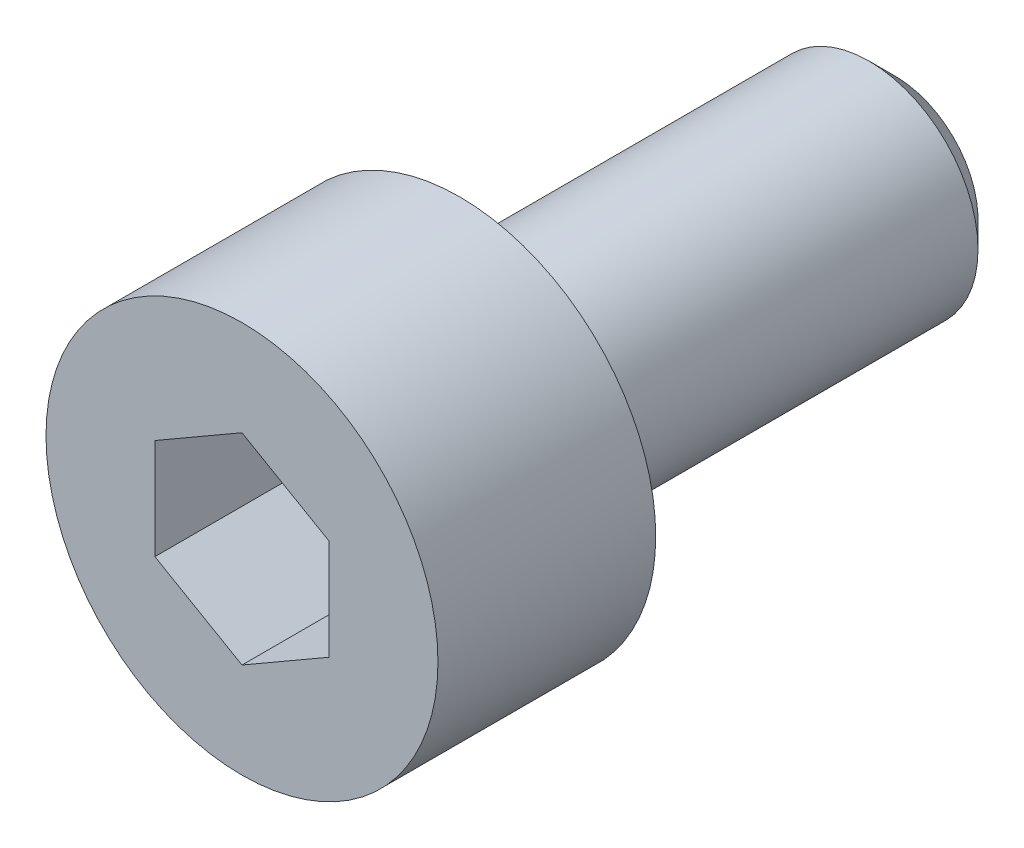
ISO-10303-21;
HEADER;
FILE_DESCRIPTION(('STEP AP214'),'2;1');
FILE_NAME('part.step','',(''),(''),'','','');
FILE_SCHEMA(('AUTOMOTIVE_DESIGN { 1 0 10303 214 1 1 1 1 }'));
ENDSEC;
DATA;
#1=APPLICATION_CONTEXT('core data for automotive mechanical design processes');
#2=APPLICATION_PROTOCOL_DEFINITION('international standard','automotive_design',2000,#1);
#3=PRODUCT_CONTEXT('',#1,'mechanical');
#4=PRODUCT('Part','Part','',(#3));
#5=PRODUCT_RELATED_PRODUCT_CATEGORY('part','',(#4));
#6=PRODUCT_DEFINITION_FORMATION('','',#4);
#7=PRODUCT_DEFINITION_CONTEXT('part definition',#1,'design');
#8=PRODUCT_DEFINITION('design','',#6,#7);
#9=PRODUCT_DEFINITION_SHAPE('','',#8);
#10=(LENGTH_UNIT() NAMED_UNIT(*) SI_UNIT(.MILLI.,.METRE.));
#11=(NAMED_UNIT(*) PLANE_ANGLE_UNIT() SI_UNIT($,.RADIAN.));
#12=(NAMED_UNIT(*) SI_UNIT($,.STERADIAN.) SOLID_ANGLE_UNIT());
#13=UNCERTAINTY_MEASURE_WITH_UNIT(LENGTH_MEASURE(1.E-05),#10,'distance_accuracy_value','');
#14=(GEOMETRIC_REPRESENTATION_CONTEXT(3) GLOBAL_UNCERTAINTY_ASSIGNED_CONTEXT((#13)) GLOBAL_UNIT_ASSIGNED_CONTEXT((#10,
#11,#12)) REPRESENTATION_CONTEXT('',''));
#15=CARTESIAN_POINT('',(0.,0.,0.));
#16=DIRECTION('',(0.,0.,1.));
#17=DIRECTION('',(1.,0.,0.));
#18=AXIS2_PLACEMENT_3D('',#15,#16,#17);
#19=CARTESIAN_POINT('',(0.,0.,0.));
#20=DIRECTION('',(0.,0.,1.));
#21=DIRECTION('',(1.,0.,0.));
#22=AXIS2_PLACEMENT_3D('',#19,#20,#21);
#23=PLANE('',#22);
#24=CARTESIAN_POINT('',(0.,0.,0.));
#25=DIRECTION('',(0.,0.,1.));
#26=DIRECTION('',(1.,0.,0.));
#27=AXIS2_PLACEMENT_3D('',#24,#25,#26);
#28=CIRCLE('',#27,2.25);
#29=CARTESIAN_POINT('',(2.25,0.,0.));
#30=VERTEX_POINT('',#29);
#31=EDGE_CURVE('E136',#30,#30,#28,.T.);
#32=ORIENTED_EDGE('',*,*,#31,.F.);
#33=EDGE_LOOP('',(#32));
#34=FACE_BOUND('',#33,.T.);
#35=CARTESIAN_POINT('',(0.,0.,0.));
#36=DIRECTION('',(0.,0.,1.));
#37=DIRECTION('',(1.,0.,0.));
#38=AXIS2_PLACEMENT_3D('',#35,#36,#37);
#39=CIRCLE('',#38,1.25);
#40=CARTESIAN_POINT('',(1.25,0.,0.));
#41=VERTEX_POINT('',#40);
#42=EDGE_CURVE('E145',#41,#41,#39,.F.);
#43=ORIENTED_EDGE('',*,*,#42,.F.);
#44=EDGE_LOOP('',(#43));
#45=FACE_BOUND('',#44,.T.);
#46=ADVANCED_FACE('F34',(#34,#45),#23,.F.);
#47=CARTESIAN_POINT('',(0.,0.,2.5));
#48=DIRECTION('',(0.,0.,-1.));
#49=DIRECTION('',(-1.,0.,0.));
#50=AXIS2_PLACEMENT_3D('',#47,#48,#49);
#51=CYLINDRICAL_SURFACE('',#50,2.25);
#52=CARTESIAN_POINT('',(0.,0.,2.5));
#53=DIRECTION('',(0.,0.,1.));
#54=DIRECTION('',(1.,0.,0.));
#55=AXIS2_PLACEMENT_3D('',#52,#53,#54);
#56=CIRCLE('',#55,2.25);
#57=CARTESIAN_POINT('',(2.25,0.,2.5));
#58=VERTEX_POINT('',#57);
#59=EDGE_CURVE('E142',#58,#58,#56,.T.);
#60=ORIENTED_EDGE('',*,*,#59,.F.);
#61=EDGE_LOOP('',(#60));
#62=FACE_BOUND('',#61,.T.);
#63=ORIENTED_EDGE('',*,*,#31,.T.);
#64=EDGE_LOOP('',(#63));
#65=FACE_BOUND('',#64,.T.);
#66=ADVANCED_FACE('F167',(#62,#65),#51,.T.);
#67=CARTESIAN_POINT('',(0.,0.,2.5));
#68=DIRECTION('',(0.,0.,1.));
#69=DIRECTION('',(1.,0.,0.));
#70=AXIS2_PLACEMENT_3D('',#67,#68,#69);
#71=PLANE('',#70);
#72=DIRECTION('',(-0.866025403784439,0.5,0.));
#73=VECTOR('',#72,1.);
#74=CARTESIAN_POINT('',(0.999999999999999,0.577350269189626,2.5));
#75=LINE('',#74,#73);
#76=CARTESIAN_POINT('',(0.999999999999999,0.577350269189626,2.5));
#77=VERTEX_POINT('',#76);
#78=CARTESIAN_POINT('',(0.,1.15470053837925,2.5));
#79=VERTEX_POINT('',#78);
#80=EDGE_CURVE('E49',#77,#79,#75,.T.);
#81=ORIENTED_EDGE('',*,*,#80,.F.);
#82=DIRECTION('',(0.,1.,0.));
#83=VECTOR('',#82,1.);
#84=CARTESIAN_POINT('',(0.999999999999999,-0.577350269189626,2.5));
#85=LINE('',#84,#83);
#86=CARTESIAN_POINT('',(0.999999999999999,-0.577350269189626,2.5));
#87=VERTEX_POINT('',#86);
#88=EDGE_CURVE('E132',#87,#77,#85,.T.);
#89=ORIENTED_EDGE('',*,*,#88,.F.);
#90=DIRECTION('',(0.866025403784439,0.5,0.));
#91=VECTOR('',#90,1.);
#92=CARTESIAN_POINT('',(0.,-1.15470053837925,2.5));
#93=LINE('',#92,#91);
#94=CARTESIAN_POINT('',(0.,-1.15470053837925,2.5));
#95=VERTEX_POINT('',#94);
#96=EDGE_CURVE('E130',#95,#87,#93,.T.);
#97=ORIENTED_EDGE('',*,*,#96,.F.);
#98=DIRECTION('',(0.866025403784438,-0.5,0.));
#99=VECTOR('',#98,1.);
#100=CARTESIAN_POINT('',(-1.,-0.577350269189626,2.5));
#101=LINE('',#100,#99);
#102=CARTESIAN_POINT('',(-1.,-0.577350269189626,2.5));
#103=VERTEX_POINT('',#102);
#104=EDGE_CURVE('E97',#103,#95,#101,.T.);
#105=ORIENTED_EDGE('',*,*,#104,.F.);
#106=DIRECTION('',(0.,-1.,0.));
#107=VECTOR('',#106,1.);
#108=CARTESIAN_POINT('',(-1.,0.577350269189626,2.5));
#109=LINE('',#108,#107);
#110=CARTESIAN_POINT('',(-1.,0.577350269189626,2.5));
#111=VERTEX_POINT('',#110);
#112=EDGE_CURVE('E126',#111,#103,#109,.T.);
#113=ORIENTED_EDGE('',*,*,#112,.F.);
#114=DIRECTION('',(-0.866025403784439,-0.5,0.));
#115=VECTOR('',#114,1.);
#116=CARTESIAN_POINT('',(0.,1.15470053837925,2.5));
#117=LINE('',#116,#115);
#118=EDGE_CURVE('E123',#79,#111,#117,.T.);
#119=ORIENTED_EDGE('',*,*,#118,.F.);
#120=EDGE_LOOP('',(#81,#89,#97,#105,#113,#119));
#121=FACE_BOUND('',#120,.T.);
#122=ORIENTED_EDGE('',*,*,#59,.T.);
#123=EDGE_LOOP('',(#122));
#124=FACE_BOUND('',#123,.T.);
#125=ADVANCED_FACE('F173',(#121,#124),#71,.T.);
#126=CARTESIAN_POINT('',(0.,0.,-5.));
#127=DIRECTION('',(0.,0.,1.));
#128=DIRECTION('',(1.,0.,0.));
#129=AXIS2_PLACEMENT_3D('',#126,#127,#128);
#130=CYLINDRICAL_SURFACE('',#129,1.25);
#131=CARTESIAN_POINT('',(0.,0.,-4.7));
#132=DIRECTION('',(0.,0.,-1.));
#133=DIRECTION('',(-1.,0.,0.));
#134=AXIS2_PLACEMENT_3D('',#131,#132,#133);
#135=CIRCLE('',#134,1.25);
#136=CARTESIAN_POINT('',(-1.25,0.,-4.7));
#137=VERTEX_POINT('',#136);
#138=EDGE_CURVE('E11',#137,#137,#135,.F.);
#139=ORIENTED_EDGE('',*,*,#138,.T.);
#140=EDGE_LOOP('',(#139));
#141=FACE_BOUND('',#140,.T.);
#142=ORIENTED_EDGE('',*,*,#42,.T.);
#143=EDGE_LOOP('',(#142));
#144=FACE_BOUND('',#143,.T.);
#145=ADVANCED_FACE('F163',(#141,#144),#130,.T.);
#146=CARTESIAN_POINT('',(0.,0.,-5.));
#147=DIRECTION('',(0.,0.,-1.));
#148=DIRECTION('',(-1.,0.,0.));
#149=AXIS2_PLACEMENT_3D('',#146,#147,#148);
#150=PLANE('',#149);
#151=CARTESIAN_POINT('',(0.,0.,-5.));
#152=DIRECTION('',(0.,0.,-1.));
#153=DIRECTION('',(-1.,0.,0.));
#154=AXIS2_PLACEMENT_3D('',#151,#152,#153);
#155=CIRCLE('',#154,0.950000000000002);
#156=CARTESIAN_POINT('',(-0.950000000000002,0.,-5.));
#157=VERTEX_POINT('',#156);
#158=EDGE_CURVE('E42',#157,#157,#155,.T.);
#159=ORIENTED_EDGE('',*,*,#158,.T.);
#160=EDGE_LOOP('',(#159));
#161=FACE_BOUND('',#160,.T.);
#162=ADVANCED_FACE('F152',(#161),#150,.T.);
#163=CARTESIAN_POINT('',(0.,0.,-5.));
#164=DIRECTION('',(0.,0.,1.));
#165=DIRECTION('',(1.,0.,0.));
#166=AXIS2_PLACEMENT_3D('',#163,#164,#165);
#167=CONICAL_SURFACE('',#166,0.950000000000002,0.785398163397448);
#168=ORIENTED_EDGE('',*,*,#138,.F.);
#169=EDGE_LOOP('',(#168));
#170=FACE_BOUND('',#169,.T.);
#171=ORIENTED_EDGE('',*,*,#158,.F.);
#172=EDGE_LOOP('',(#171));
#173=FACE_BOUND('',#172,.T.);
#174=ADVANCED_FACE('F36',(#170,#173),#167,.T.);
#175=CARTESIAN_POINT('',(0.999999999999999,0.577350269189626,0.5));
#176=DIRECTION('',(0.5,0.866025403784439,0.));
#177=DIRECTION('',(-0.866025403784439,0.5,0.));
#178=AXIS2_PLACEMENT_3D('',#175,#176,#177);
#179=PLANE('',#178);
#180=ORIENTED_EDGE('',*,*,#80,.T.);
#181=DIRECTION('',(0.,0.,1.));
#182=VECTOR('',#181,1.);
#183=CARTESIAN_POINT('',(0.,1.15470053837925,0.5));
#184=LINE('',#183,#182);
#185=CARTESIAN_POINT('',(0.,1.15470053837925,0.5));
#186=VERTEX_POINT('',#185);
#187=EDGE_CURVE('E79',#186,#79,#184,.T.);
#188=ORIENTED_EDGE('',*,*,#187,.F.);
#189=DIRECTION('',(-0.866025403784439,0.5,0.));
#190=VECTOR('',#189,1.);
#191=CARTESIAN_POINT('',(0.999999999999999,0.577350269189626,0.5));
#192=LINE('',#191,#190);
#193=CARTESIAN_POINT('',(0.999999999999999,0.577350269189626,0.5));
#194=VERTEX_POINT('',#193);
#195=EDGE_CURVE('E134',#194,#186,#192,.T.);
#196=ORIENTED_EDGE('',*,*,#195,.F.);
#197=DIRECTION('',(0.,0.,1.));
#198=VECTOR('',#197,1.);
#199=CARTESIAN_POINT('',(0.999999999999999,0.577350269189626,0.5));
#200=LINE('',#199,#198);
#201=EDGE_CURVE('E57',#194,#77,#200,.T.);
#202=ORIENTED_EDGE('',*,*,#201,.T.);
#203=EDGE_LOOP('',(#180,#188,#196,#202));
#204=FACE_BOUND('',#203,.T.);
#205=ADVANCED_FACE('F155',(#204),#179,.F.);
#206=CARTESIAN_POINT('',(0.999999999999999,-0.577350269189626,0.5));
#207=DIRECTION('',(1.,0.,0.));
#208=DIRECTION('',(0.,1.,0.));
#209=AXIS2_PLACEMENT_3D('',#206,#207,#208);
#210=PLANE('',#209);
#211=ORIENTED_EDGE('',*,*,#88,.T.);
#212=ORIENTED_EDGE('',*,*,#201,.F.);
#213=DIRECTION('',(0.,1.,0.));
#214=VECTOR('',#213,1.);
#215=CARTESIAN_POINT('',(0.999999999999999,-0.577350269189626,0.5));
#216=LINE('',#215,#214);
#217=CARTESIAN_POINT('',(0.999999999999999,-0.577350269189626,0.5));
#218=VERTEX_POINT('',#217);
#219=EDGE_CURVE('E109',#218,#194,#216,.T.);
#220=ORIENTED_EDGE('',*,*,#219,.F.);
#221=DIRECTION('',(0.,0.,1.));
#222=VECTOR('',#221,1.);
#223=CARTESIAN_POINT('',(0.999999999999999,-0.577350269189626,0.5));
#224=LINE('',#223,#222);
#225=EDGE_CURVE('E101',#218,#87,#224,.T.);
#226=ORIENTED_EDGE('',*,*,#225,.T.);
#227=EDGE_LOOP('',(#211,#212,#220,#226));
#228=FACE_BOUND('',#227,.T.);
#229=ADVANCED_FACE('F161',(#228),#210,.F.);
#230=CARTESIAN_POINT('',(0.,-1.15470053837925,0.5));
#231=DIRECTION('',(0.5,-0.866025403784439,0.));
#232=DIRECTION('',(0.866025403784439,0.5,0.));
#233=AXIS2_PLACEMENT_3D('',#230,#231,#232);
#234=PLANE('',#233);
#235=ORIENTED_EDGE('',*,*,#96,.T.);
#236=ORIENTED_EDGE('',*,*,#225,.F.);
#237=DIRECTION('',(0.866025403784439,0.5,0.));
#238=VECTOR('',#237,1.);
#239=CARTESIAN_POINT('',(0.,-1.15470053837925,0.5));
#240=LINE('',#239,#238);
#241=CARTESIAN_POINT('',(0.,-1.15470053837925,0.5));
#242=VERTEX_POINT('',#241);
#243=EDGE_CURVE('E105',#242,#218,#240,.T.);
#244=ORIENTED_EDGE('',*,*,#243,.F.);
#245=DIRECTION('',(0.,0.,1.));
#246=VECTOR('',#245,1.);
#247=CARTESIAN_POINT('',(0.,-1.15470053837925,0.5));
#248=LINE('',#247,#246);
#249=EDGE_CURVE('E90',#242,#95,#248,.T.);
#250=ORIENTED_EDGE('',*,*,#249,.T.);
#251=EDGE_LOOP('',(#235,#236,#244,#250));
#252=FACE_BOUND('',#251,.T.);
#253=ADVANCED_FACE('F106',(#252),#234,.F.);
#254=CARTESIAN_POINT('',(-1.,-0.577350269189626,0.5));
#255=DIRECTION('',(-0.5,-0.866025403784439,0.));
#256=DIRECTION('',(0.866025403784438,-0.5,0.));
#257=AXIS2_PLACEMENT_3D('',#254,#255,#256);
#258=PLANE('',#257);
#259=ORIENTED_EDGE('',*,*,#104,.T.);
#260=ORIENTED_EDGE('',*,*,#249,.F.);
#261=DIRECTION('',(0.866025403784438,-0.5,0.));
#262=VECTOR('',#261,1.);
#263=CARTESIAN_POINT('',(-1.,-0.577350269189626,0.5));
#264=LINE('',#263,#262);
#265=CARTESIAN_POINT('',(-1.,-0.577350269189626,0.5));
#266=VERTEX_POINT('',#265);
#267=EDGE_CURVE('E94',#266,#242,#264,.T.);
#268=ORIENTED_EDGE('',*,*,#267,.F.);
#269=DIRECTION('',(0.,0.,1.));
#270=VECTOR('',#269,1.);
#271=CARTESIAN_POINT('',(-1.,-0.577350269189626,0.5));
#272=LINE('',#271,#270);
#273=EDGE_CURVE('E102',#266,#103,#272,.T.);
#274=ORIENTED_EDGE('',*,*,#273,.T.);
#275=EDGE_LOOP('',(#259,#260,#268,#274));
#276=FACE_BOUND('',#275,.T.);
#277=ADVANCED_FACE('F92',(#276),#258,.F.);
#278=CARTESIAN_POINT('',(-1.,0.577350269189626,0.5));
#279=DIRECTION('',(-1.,0.,0.));
#280=DIRECTION('',(0.,0.,1.));
#281=AXIS2_PLACEMENT_3D('',#278,#279,#280);
#282=PLANE('',#281);
#283=ORIENTED_EDGE('',*,*,#112,.T.);
#284=ORIENTED_EDGE('',*,*,#273,.F.);
#285=DIRECTION('',(0.,-1.,0.));
#286=VECTOR('',#285,1.);
#287=CARTESIAN_POINT('',(-1.,0.577350269189626,0.5));
#288=LINE('',#287,#286);
#289=CARTESIAN_POINT('',(-1.,0.577350269189626,0.5));
#290=VERTEX_POINT('',#289);
#291=EDGE_CURVE('E115',#290,#266,#288,.T.);
#292=ORIENTED_EDGE('',*,*,#291,.F.);
#293=DIRECTION('',(0.,0.,1.));
#294=VECTOR('',#293,1.);
#295=CARTESIAN_POINT('',(-1.,0.577350269189626,0.5));
#296=LINE('',#295,#294);
#297=EDGE_CURVE('E139',#290,#111,#296,.T.);
#298=ORIENTED_EDGE('',*,*,#297,.T.);
#299=EDGE_LOOP('',(#283,#284,#292,#298));
#300=FACE_BOUND('',#299,.T.);
#301=ADVANCED_FACE('F187',(#300),#282,.F.);
#302=CARTESIAN_POINT('',(0.,1.15470053837925,0.5));
#303=DIRECTION('',(-0.5,0.866025403784439,0.));
#304=DIRECTION('',(-0.866025403784439,-0.5,0.));
#305=AXIS2_PLACEMENT_3D('',#302,#303,#304);
#306=PLANE('',#305);
#307=ORIENTED_EDGE('',*,*,#118,.T.);
#308=ORIENTED_EDGE('',*,*,#297,.F.);
#309=DIRECTION('',(-0.866025403784439,-0.5,0.));
#310=VECTOR('',#309,1.);
#311=CARTESIAN_POINT('',(0.,1.15470053837925,0.5));
#312=LINE('',#311,#310);
#313=EDGE_CURVE('E117',#186,#290,#312,.T.);
#314=ORIENTED_EDGE('',*,*,#313,.F.);
#315=ORIENTED_EDGE('',*,*,#187,.T.);
#316=EDGE_LOOP('',(#307,#308,#314,#315));
#317=FACE_BOUND('',#316,.T.);
#318=ADVANCED_FACE('F184',(#317),#306,.F.);
#319=CARTESIAN_POINT('',(0.,0.,0.5));
#320=DIRECTION('',(0.,0.,1.));
#321=DIRECTION('',(1.,0.,0.));
#322=AXIS2_PLACEMENT_3D('',#319,#320,#321);
#323=PLANE('',#322);
#324=ORIENTED_EDGE('',*,*,#195,.T.);
#325=ORIENTED_EDGE('',*,*,#313,.T.);
#326=ORIENTED_EDGE('',*,*,#291,.T.);
#327=ORIENTED_EDGE('',*,*,#267,.T.);
#328=ORIENTED_EDGE('',*,*,#243,.T.);
#329=ORIENTED_EDGE('',*,*,#219,.T.);
#330=EDGE_LOOP('',(#324,#325,#326,#327,#328,#329));
#331=FACE_BOUND('',#330,.T.);
#332=ADVANCED_FACE('F112',(#331),#323,.T.);
#333=CLOSED_SHELL('',(#46,#66,#125,#145,#162,#174,#205,#229,#253,#277,#301,#318,#332));
#334=MANIFOLD_SOLID_BREP('B2',#333);
#335=ADVANCED_BREP_SHAPE_REPRESENTATION('',(#18,#334),#14);
#336=SHAPE_DEFINITION_REPRESENTATION(#9,#335);
ENDSEC;
END-ISO-10303-21;
